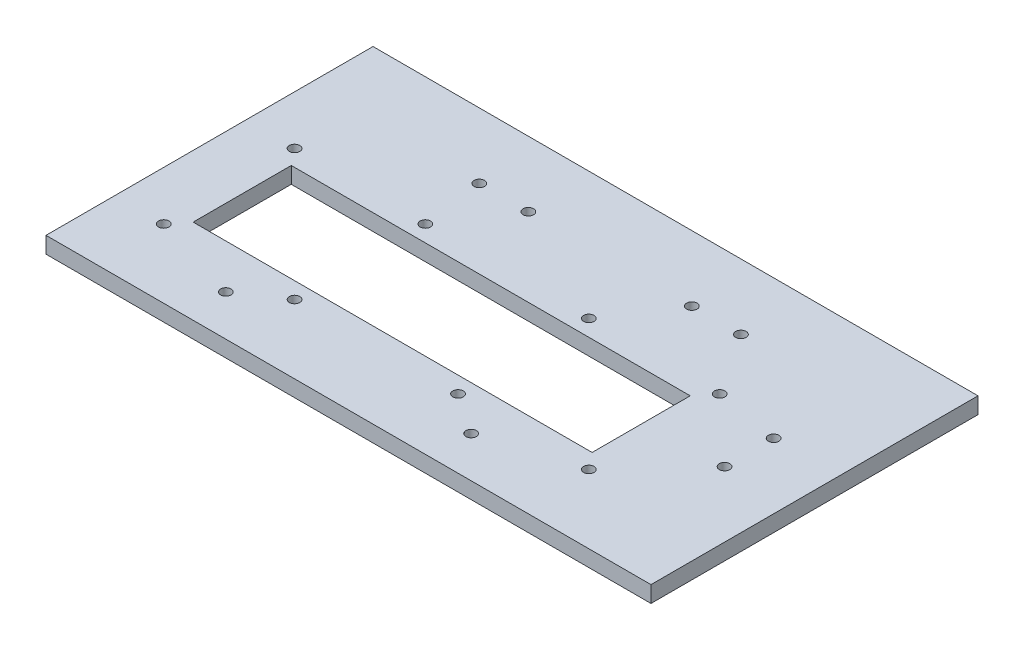
ISO-10303-21;
HEADER;
FILE_DESCRIPTION(('STEP AP214'),'2;1');
FILE_NAME('part.step','',(''),(''),'','','');
FILE_SCHEMA(('AUTOMOTIVE_DESIGN { 1 0 10303 214 1 1 1 1 }'));
ENDSEC;
DATA;
#1=APPLICATION_CONTEXT('core data for automotive mechanical design processes');
#2=APPLICATION_PROTOCOL_DEFINITION('international standard','automotive_design',2000,#1);
#3=PRODUCT_CONTEXT('',#1,'mechanical');
#4=PRODUCT('Part','Part','',(#3));
#5=PRODUCT_RELATED_PRODUCT_CATEGORY('part','',(#4));
#6=PRODUCT_DEFINITION_FORMATION('','',#4);
#7=PRODUCT_DEFINITION_CONTEXT('part definition',#1,'design');
#8=PRODUCT_DEFINITION('design','',#6,#7);
#9=PRODUCT_DEFINITION_SHAPE('','',#8);
#10=(LENGTH_UNIT() NAMED_UNIT(*) SI_UNIT(.MILLI.,.METRE.));
#11=(NAMED_UNIT(*) PLANE_ANGLE_UNIT() SI_UNIT($,.RADIAN.));
#12=(NAMED_UNIT(*) SI_UNIT($,.STERADIAN.) SOLID_ANGLE_UNIT());
#13=UNCERTAINTY_MEASURE_WITH_UNIT(LENGTH_MEASURE(1.E-05),#10,'distance_accuracy_value','');
#14=(GEOMETRIC_REPRESENTATION_CONTEXT(3) GLOBAL_UNCERTAINTY_ASSIGNED_CONTEXT((#13)) GLOBAL_UNIT_ASSIGNED_CONTEXT((#10,
#11,#12)) REPRESENTATION_CONTEXT('',''));
#15=CARTESIAN_POINT('',(0.,0.,0.));
#16=DIRECTION('',(0.,0.,1.));
#17=DIRECTION('',(1.,0.,0.));
#18=AXIS2_PLACEMENT_3D('',#15,#16,#17);
#19=CARTESIAN_POINT('',(0.,5.,0.));
#20=DIRECTION('',(0.,-1.,0.));
#21=DIRECTION('',(0.,0.,-1.));
#22=AXIS2_PLACEMENT_3D('',#19,#20,#21);
#23=PLANE('',#22);
#24=CARTESIAN_POINT('',(85.,5.,-1.49999999999997));
#25=DIRECTION('',(0.,-1.,0.));
#26=DIRECTION('',(0.,0.,-1.));
#27=AXIS2_PLACEMENT_3D('',#24,#25,#26);
#28=CIRCLE('',#27,1.60000000000001);
#29=CARTESIAN_POINT('',(85.,5.,-3.09999999999997));
#30=VERTEX_POINT('',#29);
#31=EDGE_CURVE('E287',#30,#30,#28,.F.);
#32=ORIENTED_EDGE('',*,*,#31,.F.);
#33=EDGE_LOOP('',(#32));
#34=FACE_BOUND('',#33,.T.);
#35=CARTESIAN_POINT('',(85.,5.,-16.5));
#36=DIRECTION('',(0.,-1.,0.));
#37=DIRECTION('',(0.,0.,-1.));
#38=AXIS2_PLACEMENT_3D('',#35,#36,#37);
#39=CIRCLE('',#38,1.6);
#40=CARTESIAN_POINT('',(85.,5.,-18.1));
#41=VERTEX_POINT('',#40);
#42=EDGE_CURVE('E293',#41,#41,#39,.F.);
#43=ORIENTED_EDGE('',*,*,#42,.F.);
#44=EDGE_LOOP('',(#43));
#45=FACE_BOUND('',#44,.T.);
#46=CARTESIAN_POINT('',(-37.5,5.,28.5));
#47=DIRECTION('',(0.,1.,0.));
#48=DIRECTION('',(0.,0.,1.));
#49=AXIS2_PLACEMENT_3D('',#46,#47,#48);
#50=CIRCLE('',#49,1.6);
#51=CARTESIAN_POINT('',(-37.5,5.,30.1));
#52=VERTEX_POINT('',#51);
#53=EDGE_CURVE('E301',#52,#52,#50,.T.);
#54=ORIENTED_EDGE('',*,*,#53,.F.);
#55=EDGE_LOOP('',(#54));
#56=FACE_BOUND('',#55,.T.);
#57=CARTESIAN_POINT('',(37.5,5.,28.4999999999998));
#58=DIRECTION('',(0.,1.,0.));
#59=DIRECTION('',(0.,0.,-1.));
#60=AXIS2_PLACEMENT_3D('',#57,#58,#59);
#61=CIRCLE('',#60,1.6);
#62=CARTESIAN_POINT('',(37.5,5.,26.8999999999998));
#63=VERTEX_POINT('',#62);
#64=EDGE_CURVE('E291',#63,#63,#61,.T.);
#65=ORIENTED_EDGE('',*,*,#64,.F.);
#66=EDGE_LOOP('',(#65));
#67=FACE_BOUND('',#66,.T.);
#68=CARTESIAN_POINT('',(-27.5,5.,-39.));
#69=DIRECTION('',(0.,1.,0.));
#70=DIRECTION('',(0.,0.,1.));
#71=AXIS2_PLACEMENT_3D('',#68,#69,#70);
#72=CIRCLE('',#71,1.6);
#73=CARTESIAN_POINT('',(-27.5,5.,-37.4));
#74=VERTEX_POINT('',#73);
#75=EDGE_CURVE('E310',#74,#74,#72,.T.);
#76=ORIENTED_EDGE('',*,*,#75,.F.);
#77=EDGE_LOOP('',(#76));
#78=FACE_BOUND('',#77,.T.);
#79=CARTESIAN_POINT('',(-12.5,5.,-39.));
#80=DIRECTION('',(0.,1.,0.));
#81=DIRECTION('',(0.,0.,1.));
#82=AXIS2_PLACEMENT_3D('',#79,#80,#81);
#83=CIRCLE('',#82,1.6);
#84=CARTESIAN_POINT('',(-12.5,5.,-37.4));
#85=VERTEX_POINT('',#84);
#86=EDGE_CURVE('E317',#85,#85,#83,.T.);
#87=ORIENTED_EDGE('',*,*,#86,.F.);
#88=EDGE_LOOP('',(#87));
#89=FACE_BOUND('',#88,.T.);
#90=CARTESIAN_POINT('',(37.5,5.,-39.));
#91=DIRECTION('',(0.,1.,0.));
#92=DIRECTION('',(0.,0.,-1.));
#93=AXIS2_PLACEMENT_3D('',#90,#91,#92);
#94=CIRCLE('',#93,1.6);
#95=CARTESIAN_POINT('',(37.5,5.,-40.6));
#96=VERTEX_POINT('',#95);
#97=EDGE_CURVE('E323',#96,#96,#94,.T.);
#98=ORIENTED_EDGE('',*,*,#97,.F.);
#99=EDGE_LOOP('',(#98));
#100=FACE_BOUND('',#99,.T.);
#101=CARTESIAN_POINT('',(52.5,5.,-39.));
#102=DIRECTION('',(0.,1.,0.));
#103=DIRECTION('',(0.,0.,-1.));
#104=AXIS2_PLACEMENT_3D('',#101,#102,#103);
#105=CIRCLE('',#104,1.6);
#106=CARTESIAN_POINT('',(52.5,5.,-40.6));
#107=VERTEX_POINT('',#106);
#108=EDGE_CURVE('E329',#107,#107,#105,.T.);
#109=ORIENTED_EDGE('',*,*,#108,.F.);
#110=EDGE_LOOP('',(#109));
#111=FACE_BOUND('',#110,.T.);
#112=CARTESIAN_POINT('',(25.,5.,-20.));
#113=DIRECTION('',(0.,-1.,0.));
#114=DIRECTION('',(0.,0.,-1.));
#115=AXIS2_PLACEMENT_3D('',#112,#113,#114);
#116=CIRCLE('',#115,1.6);
#117=CARTESIAN_POINT('',(25.,5.,-21.6));
#118=VERTEX_POINT('',#117);
#119=EDGE_CURVE('E356',#118,#118,#116,.T.);
#120=ORIENTED_EDGE('',*,*,#119,.T.);
#121=EDGE_LOOP('',(#120));
#122=FACE_BOUND('',#121,.T.);
#123=CARTESIAN_POINT('',(25.0000000000004,5.,20.));
#124=DIRECTION('',(0.,-1.,0.));
#125=DIRECTION('',(0.,0.,-1.));
#126=AXIS2_PLACEMENT_3D('',#123,#124,#125);
#127=CIRCLE('',#126,1.6);
#128=CARTESIAN_POINT('',(25.0000000000004,5.,18.4));
#129=VERTEX_POINT('',#128);
#130=EDGE_CURVE('E362',#129,#129,#127,.T.);
#131=ORIENTED_EDGE('',*,*,#130,.T.);
#132=EDGE_LOOP('',(#131));
#133=FACE_BOUND('',#132,.T.);
#134=CARTESIAN_POINT('',(-24.9999999999996,5.,20.));
#135=DIRECTION('',(0.,-1.,0.));
#136=DIRECTION('',(0.,0.,-1.));
#137=AXIS2_PLACEMENT_3D('',#134,#135,#136);
#138=CIRCLE('',#137,1.6);
#139=CARTESIAN_POINT('',(-24.9999999999996,5.,18.4));
#140=VERTEX_POINT('',#139);
#141=EDGE_CURVE('E368',#140,#140,#138,.T.);
#142=ORIENTED_EDGE('',*,*,#141,.T.);
#143=EDGE_LOOP('',(#142));
#144=FACE_BOUND('',#143,.T.);
#145=CARTESIAN_POINT('',(-65.,5.,-20.));
#146=DIRECTION('',(0.,-1.,0.));
#147=DIRECTION('',(0.,0.,-1.));
#148=AXIS2_PLACEMENT_3D('',#145,#146,#147);
#149=CIRCLE('',#148,1.6);
#150=CARTESIAN_POINT('',(-65.,5.,-21.6));
#151=VERTEX_POINT('',#150);
#152=EDGE_CURVE('E337',#151,#151,#149,.T.);
#153=ORIENTED_EDGE('',*,*,#152,.T.);
#154=EDGE_LOOP('',(#153));
#155=FACE_BOUND('',#154,.T.);
#156=CARTESIAN_POINT('',(65.,5.,-20.));
#157=DIRECTION('',(0.,-1.,0.));
#158=DIRECTION('',(0.,0.,-1.));
#159=AXIS2_PLACEMENT_3D('',#156,#157,#158);
#160=CIRCLE('',#159,1.6);
#161=CARTESIAN_POINT('',(65.,5.,-21.6));
#162=VERTEX_POINT('',#161);
#163=EDGE_CURVE('E338',#162,#162,#160,.T.);
#164=ORIENTED_EDGE('',*,*,#163,.T.);
#165=EDGE_LOOP('',(#164));
#166=FACE_BOUND('',#165,.T.);
#167=CARTESIAN_POINT('',(65.0000000000004,5.,20.));
#168=DIRECTION('',(0.,-1.,0.));
#169=DIRECTION('',(0.,0.,-1.));
#170=AXIS2_PLACEMENT_3D('',#167,#168,#169);
#171=CIRCLE('',#170,1.6);
#172=CARTESIAN_POINT('',(65.0000000000004,5.,18.4));
#173=VERTEX_POINT('',#172);
#174=EDGE_CURVE('E344',#173,#173,#171,.T.);
#175=ORIENTED_EDGE('',*,*,#174,.T.);
#176=EDGE_LOOP('',(#175));
#177=FACE_BOUND('',#176,.T.);
#178=CARTESIAN_POINT('',(-64.9999999999996,5.,20.));
#179=DIRECTION('',(0.,-1.,0.));
#180=DIRECTION('',(0.,0.,-1.));
#181=AXIS2_PLACEMENT_3D('',#178,#179,#180);
#182=CIRCLE('',#181,1.6);
#183=CARTESIAN_POINT('',(-64.9999999999996,5.,18.4));
#184=VERTEX_POINT('',#183);
#185=EDGE_CURVE('E313',#184,#184,#182,.T.);
#186=ORIENTED_EDGE('',*,*,#185,.T.);
#187=EDGE_LOOP('',(#186));
#188=FACE_BOUND('',#187,.T.);
#189=CARTESIAN_POINT('',(-25.,5.,-20.));
#190=DIRECTION('',(0.,-1.,0.));
#191=DIRECTION('',(0.,0.,-1.));
#192=AXIS2_PLACEMENT_3D('',#189,#190,#191);
#193=CIRCLE('',#192,1.6);
#194=CARTESIAN_POINT('',(-25.,5.,-21.6));
#195=VERTEX_POINT('',#194);
#196=EDGE_CURVE('E355',#195,#195,#193,.T.);
#197=ORIENTED_EDGE('',*,*,#196,.T.);
#198=EDGE_LOOP('',(#197));
#199=FACE_BOUND('',#198,.T.);
#200=DIRECTION('',(-1.,0.,0.));
#201=VECTOR('',#200,1.);
#202=CARTESIAN_POINT('',(105.,5.,-59.));
#203=LINE('',#202,#201);
#204=CARTESIAN_POINT('',(105.,5.,-59.));
#205=VERTEX_POINT('',#204);
#206=CARTESIAN_POINT('',(-80.,5.,-59.));
#207=VERTEX_POINT('',#206);
#208=EDGE_CURVE('E136',#205,#207,#203,.T.);
#209=ORIENTED_EDGE('',*,*,#208,.T.);
#210=DIRECTION('',(0.,0.,1.));
#211=VECTOR('',#210,1.);
#212=CARTESIAN_POINT('',(-80.,5.,41.));
#213=LINE('',#212,#211);
#214=CARTESIAN_POINT('',(-80.,5.,41.));
#215=VERTEX_POINT('',#214);
#216=EDGE_CURVE('E139',#207,#215,#213,.T.);
#217=ORIENTED_EDGE('',*,*,#216,.T.);
#218=DIRECTION('',(1.,0.,0.));
#219=VECTOR('',#218,1.);
#220=CARTESIAN_POINT('',(105.,5.,41.));
#221=LINE('',#220,#219);
#222=CARTESIAN_POINT('',(105.,5.,41.));
#223=VERTEX_POINT('',#222);
#224=EDGE_CURVE('E142',#215,#223,#221,.T.);
#225=ORIENTED_EDGE('',*,*,#224,.T.);
#226=DIRECTION('',(0.,0.,-1.));
#227=VECTOR('',#226,1.);
#228=CARTESIAN_POINT('',(105.,5.,41.));
#229=LINE('',#228,#227);
#230=EDGE_CURVE('E144',#223,#205,#229,.T.);
#231=ORIENTED_EDGE('',*,*,#230,.T.);
#232=EDGE_LOOP('',(#209,#217,#225,#231));
#233=FACE_BOUND('',#232,.T.);
#234=DIRECTION('',(0.,0.,-1.));
#235=VECTOR('',#234,1.);
#236=CARTESIAN_POINT('',(61.,5.,15.));
#237=LINE('',#236,#235);
#238=CARTESIAN_POINT('',(61.,5.,15.));
#239=VERTEX_POINT('',#238);
#240=CARTESIAN_POINT('',(61.,5.,-15.));
#241=VERTEX_POINT('',#240);
#242=EDGE_CURVE('E98',#239,#241,#237,.T.);
#243=ORIENTED_EDGE('',*,*,#242,.F.);
#244=DIRECTION('',(1.,0.,0.));
#245=VECTOR('',#244,1.);
#246=CARTESIAN_POINT('',(-61.,5.,15.));
#247=LINE('',#246,#245);
#248=CARTESIAN_POINT('',(-61.,5.,15.));
#249=VERTEX_POINT('',#248);
#250=EDGE_CURVE('E120',#249,#239,#247,.T.);
#251=ORIENTED_EDGE('',*,*,#250,.F.);
#252=DIRECTION('',(0.,0.,1.));
#253=VECTOR('',#252,1.);
#254=CARTESIAN_POINT('',(-61.,5.,15.));
#255=LINE('',#254,#253);
#256=CARTESIAN_POINT('',(-61.,5.,-15.));
#257=VERTEX_POINT('',#256);
#258=EDGE_CURVE('E118',#257,#249,#255,.T.);
#259=ORIENTED_EDGE('',*,*,#258,.F.);
#260=DIRECTION('',(-1.,0.,0.));
#261=VECTOR('',#260,1.);
#262=CARTESIAN_POINT('',(-61.,5.,-15.));
#263=LINE('',#262,#261);
#264=EDGE_CURVE('E106',#241,#257,#263,.T.);
#265=ORIENTED_EDGE('',*,*,#264,.F.);
#266=EDGE_LOOP('',(#243,#251,#259,#265));
#267=FACE_BOUND('',#266,.T.);
#268=ADVANCED_FACE('F33',(#34,#45,#56,#67,#78,#89,#100,#111,#122,#133,#144,#155,#166,#177,#188,
#199,#233,#267),#23,.F.);
#269=CARTESIAN_POINT('',(0.,0.,0.));
#270=DIRECTION('',(0.,-1.,0.));
#271=DIRECTION('',(0.,0.,-1.));
#272=AXIS2_PLACEMENT_3D('',#269,#270,#271);
#273=PLANE('',#272);
#274=CARTESIAN_POINT('',(85.,0.,-1.49999999999997));
#275=DIRECTION('',(0.,-1.,0.));
#276=DIRECTION('',(0.,0.,-1.));
#277=AXIS2_PLACEMENT_3D('',#274,#275,#276);
#278=CIRCLE('',#277,1.60000000000001);
#279=CARTESIAN_POINT('',(85.,0.,-3.09999999999997));
#280=VERTEX_POINT('',#279);
#281=EDGE_CURVE('E285',#280,#280,#278,.T.);
#282=ORIENTED_EDGE('',*,*,#281,.F.);
#283=EDGE_LOOP('',(#282));
#284=FACE_BOUND('',#283,.T.);
#285=CARTESIAN_POINT('',(85.,0.,-16.5));
#286=DIRECTION('',(0.,-1.,0.));
#287=DIRECTION('',(0.,0.,1.));
#288=AXIS2_PLACEMENT_3D('',#285,#286,#287);
#289=CIRCLE('',#288,1.6);
#290=CARTESIAN_POINT('',(85.,0.,-14.9));
#291=VERTEX_POINT('',#290);
#292=EDGE_CURVE('E296',#291,#291,#289,.T.);
#293=ORIENTED_EDGE('',*,*,#292,.F.);
#294=EDGE_LOOP('',(#293));
#295=FACE_BOUND('',#294,.T.);
#296=CARTESIAN_POINT('',(-37.5,0.,28.5));
#297=DIRECTION('',(0.,-1.,0.));
#298=DIRECTION('',(0.,0.,-1.));
#299=AXIS2_PLACEMENT_3D('',#296,#297,#298);
#300=CIRCLE('',#299,1.6);
#301=CARTESIAN_POINT('',(-37.5,0.,26.9));
#302=VERTEX_POINT('',#301);
#303=EDGE_CURVE('E305',#302,#302,#300,.F.);
#304=ORIENTED_EDGE('',*,*,#303,.T.);
#305=EDGE_LOOP('',(#304));
#306=FACE_BOUND('',#305,.T.);
#307=CARTESIAN_POINT('',(37.5,0.,28.4999999999998));
#308=DIRECTION('',(0.,-1.,0.));
#309=DIRECTION('',(0.,0.,-1.));
#310=AXIS2_PLACEMENT_3D('',#307,#308,#309);
#311=CIRCLE('',#310,1.6);
#312=CARTESIAN_POINT('',(37.5,0.,26.8999999999998));
#313=VERTEX_POINT('',#312);
#314=EDGE_CURVE('E288',#313,#313,#311,.F.);
#315=ORIENTED_EDGE('',*,*,#314,.T.);
#316=EDGE_LOOP('',(#315));
#317=FACE_BOUND('',#316,.T.);
#318=CARTESIAN_POINT('',(-27.5,0.,-39.));
#319=DIRECTION('',(0.,-1.,0.));
#320=DIRECTION('',(0.,0.,-1.));
#321=AXIS2_PLACEMENT_3D('',#318,#319,#320);
#322=CIRCLE('',#321,1.6);
#323=CARTESIAN_POINT('',(-27.5,0.,-40.6));
#324=VERTEX_POINT('',#323);
#325=EDGE_CURVE('E314',#324,#324,#322,.F.);
#326=ORIENTED_EDGE('',*,*,#325,.T.);
#327=EDGE_LOOP('',(#326));
#328=FACE_BOUND('',#327,.T.);
#329=CARTESIAN_POINT('',(-12.5,0.,-39.));
#330=DIRECTION('',(0.,-1.,0.));
#331=DIRECTION('',(0.,0.,-1.));
#332=AXIS2_PLACEMENT_3D('',#329,#330,#331);
#333=CIRCLE('',#332,1.6);
#334=CARTESIAN_POINT('',(-12.5,0.,-40.6));
#335=VERTEX_POINT('',#334);
#336=EDGE_CURVE('E320',#335,#335,#333,.F.);
#337=ORIENTED_EDGE('',*,*,#336,.T.);
#338=EDGE_LOOP('',(#337));
#339=FACE_BOUND('',#338,.T.);
#340=CARTESIAN_POINT('',(37.5,0.,-39.));
#341=DIRECTION('',(0.,-1.,0.));
#342=DIRECTION('',(0.,0.,-1.));
#343=AXIS2_PLACEMENT_3D('',#340,#341,#342);
#344=CIRCLE('',#343,1.6);
#345=CARTESIAN_POINT('',(37.5,0.,-40.6));
#346=VERTEX_POINT('',#345);
#347=EDGE_CURVE('E326',#346,#346,#344,.F.);
#348=ORIENTED_EDGE('',*,*,#347,.T.);
#349=EDGE_LOOP('',(#348));
#350=FACE_BOUND('',#349,.T.);
#351=CARTESIAN_POINT('',(52.5,0.,-39.));
#352=DIRECTION('',(0.,-1.,0.));
#353=DIRECTION('',(0.,0.,-1.));
#354=AXIS2_PLACEMENT_3D('',#351,#352,#353);
#355=CIRCLE('',#354,1.6);
#356=CARTESIAN_POINT('',(52.5,0.,-40.6));
#357=VERTEX_POINT('',#356);
#358=EDGE_CURVE('E304',#357,#357,#355,.F.);
#359=ORIENTED_EDGE('',*,*,#358,.T.);
#360=EDGE_LOOP('',(#359));
#361=FACE_BOUND('',#360,.T.);
#362=CARTESIAN_POINT('',(25.,0.,-20.));
#363=DIRECTION('',(0.,1.,0.));
#364=DIRECTION('',(0.,0.,1.));
#365=AXIS2_PLACEMENT_3D('',#362,#363,#364);
#366=CIRCLE('',#365,1.6);
#367=CARTESIAN_POINT('',(25.,0.,-18.4));
#368=VERTEX_POINT('',#367);
#369=EDGE_CURVE('E352',#368,#368,#366,.T.);
#370=ORIENTED_EDGE('',*,*,#369,.T.);
#371=EDGE_LOOP('',(#370));
#372=FACE_BOUND('',#371,.T.);
#373=CARTESIAN_POINT('',(25.0000000000004,0.,20.));
#374=DIRECTION('',(0.,1.,0.));
#375=DIRECTION('',(0.,0.,1.));
#376=AXIS2_PLACEMENT_3D('',#373,#374,#375);
#377=CIRCLE('',#376,1.6);
#378=CARTESIAN_POINT('',(25.0000000000004,0.,21.6));
#379=VERTEX_POINT('',#378);
#380=EDGE_CURVE('E359',#379,#379,#377,.T.);
#381=ORIENTED_EDGE('',*,*,#380,.T.);
#382=EDGE_LOOP('',(#381));
#383=FACE_BOUND('',#382,.T.);
#384=CARTESIAN_POINT('',(-24.9999999999996,0.,20.));
#385=DIRECTION('',(0.,1.,0.));
#386=DIRECTION('',(0.,0.,1.));
#387=AXIS2_PLACEMENT_3D('',#384,#385,#386);
#388=CIRCLE('',#387,1.6);
#389=CARTESIAN_POINT('',(-24.9999999999996,0.,21.6));
#390=VERTEX_POINT('',#389);
#391=EDGE_CURVE('E365',#390,#390,#388,.T.);
#392=ORIENTED_EDGE('',*,*,#391,.T.);
#393=EDGE_LOOP('',(#392));
#394=FACE_BOUND('',#393,.T.);
#395=CARTESIAN_POINT('',(-65.,0.,-20.));
#396=DIRECTION('',(0.,1.,0.));
#397=DIRECTION('',(0.,0.,1.));
#398=AXIS2_PLACEMENT_3D('',#395,#396,#397);
#399=CIRCLE('',#398,1.6);
#400=CARTESIAN_POINT('',(-65.,0.,-18.4));
#401=VERTEX_POINT('',#400);
#402=EDGE_CURVE('E371',#401,#401,#399,.T.);
#403=ORIENTED_EDGE('',*,*,#402,.T.);
#404=EDGE_LOOP('',(#403));
#405=FACE_BOUND('',#404,.T.);
#406=CARTESIAN_POINT('',(65.,0.,-20.));
#407=DIRECTION('',(0.,1.,0.));
#408=DIRECTION('',(0.,0.,1.));
#409=AXIS2_PLACEMENT_3D('',#406,#407,#408);
#410=CIRCLE('',#409,1.6);
#411=CARTESIAN_POINT('',(65.,0.,-18.4));
#412=VERTEX_POINT('',#411);
#413=EDGE_CURVE('E334',#412,#412,#410,.T.);
#414=ORIENTED_EDGE('',*,*,#413,.T.);
#415=EDGE_LOOP('',(#414));
#416=FACE_BOUND('',#415,.T.);
#417=CARTESIAN_POINT('',(65.0000000000004,0.,20.));
#418=DIRECTION('',(0.,1.,0.));
#419=DIRECTION('',(0.,0.,1.));
#420=AXIS2_PLACEMENT_3D('',#417,#418,#419);
#421=CIRCLE('',#420,1.6);
#422=CARTESIAN_POINT('',(65.0000000000004,0.,21.6));
#423=VERTEX_POINT('',#422);
#424=EDGE_CURVE('E341',#423,#423,#421,.T.);
#425=ORIENTED_EDGE('',*,*,#424,.T.);
#426=EDGE_LOOP('',(#425));
#427=FACE_BOUND('',#426,.T.);
#428=CARTESIAN_POINT('',(-64.9999999999996,0.,20.));
#429=DIRECTION('',(0.,1.,0.));
#430=DIRECTION('',(0.,0.,1.));
#431=AXIS2_PLACEMENT_3D('',#428,#429,#430);
#432=CIRCLE('',#431,1.6);
#433=CARTESIAN_POINT('',(-64.9999999999996,0.,21.6));
#434=VERTEX_POINT('',#433);
#435=EDGE_CURVE('E347',#434,#434,#432,.T.);
#436=ORIENTED_EDGE('',*,*,#435,.T.);
#437=EDGE_LOOP('',(#436));
#438=FACE_BOUND('',#437,.T.);
#439=CARTESIAN_POINT('',(-25.,0.,-20.));
#440=DIRECTION('',(0.,1.,0.));
#441=DIRECTION('',(0.,0.,1.));
#442=AXIS2_PLACEMENT_3D('',#439,#440,#441);
#443=CIRCLE('',#442,1.6);
#444=CARTESIAN_POINT('',(-25.,0.,-18.4));
#445=VERTEX_POINT('',#444);
#446=EDGE_CURVE('E126',#445,#445,#443,.T.);
#447=ORIENTED_EDGE('',*,*,#446,.T.);
#448=EDGE_LOOP('',(#447));
#449=FACE_BOUND('',#448,.T.);
#450=DIRECTION('',(-1.,0.,0.));
#451=VECTOR('',#450,1.);
#452=CARTESIAN_POINT('',(105.,0.,-59.));
#453=LINE('',#452,#451);
#454=CARTESIAN_POINT('',(105.,0.,-59.));
#455=VERTEX_POINT('',#454);
#456=CARTESIAN_POINT('',(-80.,0.,-59.));
#457=VERTEX_POINT('',#456);
#458=EDGE_CURVE('E114',#455,#457,#453,.T.);
#459=ORIENTED_EDGE('',*,*,#458,.F.);
#460=DIRECTION('',(0.,0.,-1.));
#461=VECTOR('',#460,1.);
#462=CARTESIAN_POINT('',(105.,0.,41.));
#463=LINE('',#462,#461);
#464=CARTESIAN_POINT('',(105.,0.,41.));
#465=VERTEX_POINT('',#464);
#466=EDGE_CURVE('E140',#465,#455,#463,.T.);
#467=ORIENTED_EDGE('',*,*,#466,.F.);
#468=DIRECTION('',(1.,0.,0.));
#469=VECTOR('',#468,1.);
#470=CARTESIAN_POINT('',(105.,0.,41.));
#471=LINE('',#470,#469);
#472=CARTESIAN_POINT('',(-80.,0.,41.));
#473=VERTEX_POINT('',#472);
#474=EDGE_CURVE('E151',#473,#465,#471,.T.);
#475=ORIENTED_EDGE('',*,*,#474,.F.);
#476=DIRECTION('',(0.,0.,1.));
#477=VECTOR('',#476,1.);
#478=CARTESIAN_POINT('',(-80.,0.,41.));
#479=LINE('',#478,#477);
#480=EDGE_CURVE('E149',#457,#473,#479,.T.);
#481=ORIENTED_EDGE('',*,*,#480,.F.);
#482=EDGE_LOOP('',(#459,#467,#475,#481));
#483=FACE_BOUND('',#482,.T.);
#484=DIRECTION('',(1.,0.,0.));
#485=VECTOR('',#484,1.);
#486=CARTESIAN_POINT('',(-61.,0.,15.));
#487=LINE('',#486,#485);
#488=CARTESIAN_POINT('',(-61.,0.,15.));
#489=VERTEX_POINT('',#488);
#490=CARTESIAN_POINT('',(61.,0.,15.));
#491=VERTEX_POINT('',#490);
#492=EDGE_CURVE('E107',#489,#491,#487,.T.);
#493=ORIENTED_EDGE('',*,*,#492,.T.);
#494=DIRECTION('',(0.,0.,-1.));
#495=VECTOR('',#494,1.);
#496=CARTESIAN_POINT('',(61.,0.,15.));
#497=LINE('',#496,#495);
#498=CARTESIAN_POINT('',(61.,0.,-15.));
#499=VERTEX_POINT('',#498);
#500=EDGE_CURVE('E56',#491,#499,#497,.T.);
#501=ORIENTED_EDGE('',*,*,#500,.T.);
#502=DIRECTION('',(-1.,0.,0.));
#503=VECTOR('',#502,1.);
#504=CARTESIAN_POINT('',(-61.,0.,-15.));
#505=LINE('',#504,#503);
#506=CARTESIAN_POINT('',(-61.,0.,-15.));
#507=VERTEX_POINT('',#506);
#508=EDGE_CURVE('E113',#499,#507,#505,.T.);
#509=ORIENTED_EDGE('',*,*,#508,.T.);
#510=DIRECTION('',(0.,0.,1.));
#511=VECTOR('',#510,1.);
#512=CARTESIAN_POINT('',(-61.,0.,15.));
#513=LINE('',#512,#511);
#514=EDGE_CURVE('E128',#507,#489,#513,.T.);
#515=ORIENTED_EDGE('',*,*,#514,.T.);
#516=EDGE_LOOP('',(#493,#501,#509,#515));
#517=FACE_BOUND('',#516,.T.);
#518=ADVANCED_FACE('F169',(#284,#295,#306,#317,#328,#339,#350,#361,#372,#383,#394,#405,#416,
#427,#438,#449,#483,#517),#273,.T.);
#519=CARTESIAN_POINT('',(105.,5.,-59.));
#520=DIRECTION('',(0.,0.,1.));
#521=DIRECTION('',(1.,0.,0.));
#522=AXIS2_PLACEMENT_3D('',#519,#520,#521);
#523=PLANE('',#522);
#524=ORIENTED_EDGE('',*,*,#458,.T.);
#525=DIRECTION('',(0.,-1.,0.));
#526=VECTOR('',#525,1.);
#527=CARTESIAN_POINT('',(-80.,5.,-59.));
#528=LINE('',#527,#526);
#529=EDGE_CURVE('E11',#207,#457,#528,.T.);
#530=ORIENTED_EDGE('',*,*,#529,.F.);
#531=ORIENTED_EDGE('',*,*,#208,.F.);
#532=DIRECTION('',(0.,-1.,0.));
#533=VECTOR('',#532,1.);
#534=CARTESIAN_POINT('',(105.,5.,-59.));
#535=LINE('',#534,#533);
#536=EDGE_CURVE('E146',#205,#455,#535,.T.);
#537=ORIENTED_EDGE('',*,*,#536,.T.);
#538=EDGE_LOOP('',(#524,#530,#531,#537));
#539=FACE_BOUND('',#538,.T.);
#540=ADVANCED_FACE('F35',(#539),#523,.F.);
#541=CARTESIAN_POINT('',(-80.,5.,41.));
#542=DIRECTION('',(1.,0.,0.));
#543=DIRECTION('',(0.,0.,-1.));
#544=AXIS2_PLACEMENT_3D('',#541,#542,#543);
#545=PLANE('',#544);
#546=ORIENTED_EDGE('',*,*,#480,.T.);
#547=DIRECTION('',(0.,-1.,0.));
#548=VECTOR('',#547,1.);
#549=CARTESIAN_POINT('',(-80.,5.,41.));
#550=LINE('',#549,#548);
#551=EDGE_CURVE('E41',#215,#473,#550,.T.);
#552=ORIENTED_EDGE('',*,*,#551,.F.);
#553=ORIENTED_EDGE('',*,*,#216,.F.);
#554=ORIENTED_EDGE('',*,*,#529,.T.);
#555=EDGE_LOOP('',(#546,#552,#553,#554));
#556=FACE_BOUND('',#555,.T.);
#557=ADVANCED_FACE('F179',(#556),#545,.F.);
#558=CARTESIAN_POINT('',(105.,5.,41.));
#559=DIRECTION('',(0.,0.,-1.));
#560=DIRECTION('',(-1.,0.,0.));
#561=AXIS2_PLACEMENT_3D('',#558,#559,#560);
#562=PLANE('',#561);
#563=ORIENTED_EDGE('',*,*,#474,.T.);
#564=DIRECTION('',(0.,-1.,0.));
#565=VECTOR('',#564,1.);
#566=CARTESIAN_POINT('',(105.,5.,41.));
#567=LINE('',#566,#565);
#568=EDGE_CURVE('E156',#223,#465,#567,.T.);
#569=ORIENTED_EDGE('',*,*,#568,.F.);
#570=ORIENTED_EDGE('',*,*,#224,.F.);
#571=ORIENTED_EDGE('',*,*,#551,.T.);
#572=EDGE_LOOP('',(#563,#569,#570,#571));
#573=FACE_BOUND('',#572,.T.);
#574=ADVANCED_FACE('F163',(#573),#562,.F.);
#575=CARTESIAN_POINT('',(105.,5.,41.));
#576=DIRECTION('',(-1.,0.,0.));
#577=DIRECTION('',(0.,0.,1.));
#578=AXIS2_PLACEMENT_3D('',#575,#576,#577);
#579=PLANE('',#578);
#580=ORIENTED_EDGE('',*,*,#466,.T.);
#581=ORIENTED_EDGE('',*,*,#536,.F.);
#582=ORIENTED_EDGE('',*,*,#230,.F.);
#583=ORIENTED_EDGE('',*,*,#568,.T.);
#584=EDGE_LOOP('',(#580,#581,#582,#583));
#585=FACE_BOUND('',#584,.T.);
#586=ADVANCED_FACE('F173',(#585),#579,.F.);
#587=CARTESIAN_POINT('',(61.,5.,15.));
#588=DIRECTION('',(-1.,0.,0.));
#589=DIRECTION('',(0.,0.,1.));
#590=AXIS2_PLACEMENT_3D('',#587,#588,#589);
#591=PLANE('',#590);
#592=ORIENTED_EDGE('',*,*,#500,.F.);
#593=DIRECTION('',(0.,-1.,0.));
#594=VECTOR('',#593,1.);
#595=CARTESIAN_POINT('',(61.,5.,15.));
#596=LINE('',#595,#594);
#597=EDGE_CURVE('E102',#239,#491,#596,.T.);
#598=ORIENTED_EDGE('',*,*,#597,.F.);
#599=ORIENTED_EDGE('',*,*,#242,.T.);
#600=DIRECTION('',(0.,-1.,0.));
#601=VECTOR('',#600,1.);
#602=CARTESIAN_POINT('',(61.,5.,-15.));
#603=LINE('',#602,#601);
#604=EDGE_CURVE('E101',#241,#499,#603,.T.);
#605=ORIENTED_EDGE('',*,*,#604,.T.);
#606=EDGE_LOOP('',(#592,#598,#599,#605));
#607=FACE_BOUND('',#606,.T.);
#608=ADVANCED_FACE('F100',(#607),#591,.T.);
#609=CARTESIAN_POINT('',(-61.,5.,-15.));
#610=DIRECTION('',(0.,0.,1.));
#611=DIRECTION('',(1.,0.,0.));
#612=AXIS2_PLACEMENT_3D('',#609,#610,#611);
#613=PLANE('',#612);
#614=ORIENTED_EDGE('',*,*,#508,.F.);
#615=ORIENTED_EDGE('',*,*,#604,.F.);
#616=ORIENTED_EDGE('',*,*,#264,.T.);
#617=DIRECTION('',(0.,-1.,0.));
#618=VECTOR('',#617,1.);
#619=CARTESIAN_POINT('',(-61.,5.,-15.));
#620=LINE('',#619,#618);
#621=EDGE_CURVE('E115',#257,#507,#620,.T.);
#622=ORIENTED_EDGE('',*,*,#621,.T.);
#623=EDGE_LOOP('',(#614,#615,#616,#622));
#624=FACE_BOUND('',#623,.T.);
#625=ADVANCED_FACE('F110',(#624),#613,.T.);
#626=CARTESIAN_POINT('',(-61.,5.,15.));
#627=DIRECTION('',(1.,0.,0.));
#628=DIRECTION('',(0.,0.,-1.));
#629=AXIS2_PLACEMENT_3D('',#626,#627,#628);
#630=PLANE('',#629);
#631=ORIENTED_EDGE('',*,*,#514,.F.);
#632=ORIENTED_EDGE('',*,*,#621,.F.);
#633=ORIENTED_EDGE('',*,*,#258,.T.);
#634=DIRECTION('',(0.,-1.,0.));
#635=VECTOR('',#634,1.);
#636=CARTESIAN_POINT('',(-61.,5.,15.));
#637=LINE('',#636,#635);
#638=EDGE_CURVE('E48',#249,#489,#637,.T.);
#639=ORIENTED_EDGE('',*,*,#638,.T.);
#640=EDGE_LOOP('',(#631,#632,#633,#639));
#641=FACE_BOUND('',#640,.T.);
#642=ADVANCED_FACE('F207',(#641),#630,.T.);
#643=CARTESIAN_POINT('',(-61.,5.,15.));
#644=DIRECTION('',(0.,0.,-1.));
#645=DIRECTION('',(-1.,0.,0.));
#646=AXIS2_PLACEMENT_3D('',#643,#644,#645);
#647=PLANE('',#646);
#648=ORIENTED_EDGE('',*,*,#492,.F.);
#649=ORIENTED_EDGE('',*,*,#638,.F.);
#650=ORIENTED_EDGE('',*,*,#250,.T.);
#651=ORIENTED_EDGE('',*,*,#597,.T.);
#652=EDGE_LOOP('',(#648,#649,#650,#651));
#653=FACE_BOUND('',#652,.T.);
#654=ADVANCED_FACE('F211',(#653),#647,.T.);
#655=CARTESIAN_POINT('',(-25.,5.001,-20.));
#656=DIRECTION('',(0.,-1.,0.));
#657=DIRECTION('',(0.,0.,-1.));
#658=AXIS2_PLACEMENT_3D('',#655,#656,#657);
#659=CYLINDRICAL_SURFACE('',#658,1.6);
#660=ORIENTED_EDGE('',*,*,#446,.F.);
#661=EDGE_LOOP('',(#660));
#662=FACE_BOUND('',#661,.T.);
#663=ORIENTED_EDGE('',*,*,#196,.F.);
#664=EDGE_LOOP('',(#663));
#665=FACE_BOUND('',#664,.T.);
#666=ADVANCED_FACE('F217',(#662,#665),#659,.F.);
#667=CARTESIAN_POINT('',(-64.9999999999996,5.001,20.));
#668=DIRECTION('',(0.,-1.,0.));
#669=DIRECTION('',(0.,0.,-1.));
#670=AXIS2_PLACEMENT_3D('',#667,#668,#669);
#671=CYLINDRICAL_SURFACE('',#670,1.6);
#672=ORIENTED_EDGE('',*,*,#435,.F.);
#673=EDGE_LOOP('',(#672));
#674=FACE_BOUND('',#673,.T.);
#675=ORIENTED_EDGE('',*,*,#185,.F.);
#676=EDGE_LOOP('',(#675));
#677=FACE_BOUND('',#676,.T.);
#678=ADVANCED_FACE('F220',(#674,#677),#671,.F.);
#679=CARTESIAN_POINT('',(65.0000000000004,5.001,20.));
#680=DIRECTION('',(0.,-1.,0.));
#681=DIRECTION('',(0.,0.,-1.));
#682=AXIS2_PLACEMENT_3D('',#679,#680,#681);
#683=CYLINDRICAL_SURFACE('',#682,1.6);
#684=ORIENTED_EDGE('',*,*,#424,.F.);
#685=EDGE_LOOP('',(#684));
#686=FACE_BOUND('',#685,.T.);
#687=ORIENTED_EDGE('',*,*,#174,.F.);
#688=EDGE_LOOP('',(#687));
#689=FACE_BOUND('',#688,.T.);
#690=ADVANCED_FACE('F242',(#686,#689),#683,.F.);
#691=CARTESIAN_POINT('',(65.,5.001,-20.));
#692=DIRECTION('',(0.,-1.,0.));
#693=DIRECTION('',(0.,0.,-1.));
#694=AXIS2_PLACEMENT_3D('',#691,#692,#693);
#695=CYLINDRICAL_SURFACE('',#694,1.6);
#696=ORIENTED_EDGE('',*,*,#413,.F.);
#697=EDGE_LOOP('',(#696));
#698=FACE_BOUND('',#697,.T.);
#699=ORIENTED_EDGE('',*,*,#163,.F.);
#700=EDGE_LOOP('',(#699));
#701=FACE_BOUND('',#700,.T.);
#702=ADVANCED_FACE('F226',(#698,#701),#695,.F.);
#703=CARTESIAN_POINT('',(-65.,5.001,-20.));
#704=DIRECTION('',(0.,-1.,0.));
#705=DIRECTION('',(0.,0.,-1.));
#706=AXIS2_PLACEMENT_3D('',#703,#704,#705);
#707=CYLINDRICAL_SURFACE('',#706,1.6);
#708=ORIENTED_EDGE('',*,*,#402,.F.);
#709=EDGE_LOOP('',(#708));
#710=FACE_BOUND('',#709,.T.);
#711=ORIENTED_EDGE('',*,*,#152,.F.);
#712=EDGE_LOOP('',(#711));
#713=FACE_BOUND('',#712,.T.);
#714=ADVANCED_FACE('F222',(#710,#713),#707,.F.);
#715=CARTESIAN_POINT('',(-24.9999999999996,5.001,20.));
#716=DIRECTION('',(0.,-1.,0.));
#717=DIRECTION('',(0.,0.,-1.));
#718=AXIS2_PLACEMENT_3D('',#715,#716,#717);
#719=CYLINDRICAL_SURFACE('',#718,1.6);
#720=ORIENTED_EDGE('',*,*,#391,.F.);
#721=EDGE_LOOP('',(#720));
#722=FACE_BOUND('',#721,.T.);
#723=ORIENTED_EDGE('',*,*,#141,.F.);
#724=EDGE_LOOP('',(#723));
#725=FACE_BOUND('',#724,.T.);
#726=ADVANCED_FACE('F225',(#722,#725),#719,.F.);
#727=CARTESIAN_POINT('',(25.0000000000004,5.001,20.));
#728=DIRECTION('',(0.,-1.,0.));
#729=DIRECTION('',(0.,0.,-1.));
#730=AXIS2_PLACEMENT_3D('',#727,#728,#729);
#731=CYLINDRICAL_SURFACE('',#730,1.6);
#732=ORIENTED_EDGE('',*,*,#380,.F.);
#733=EDGE_LOOP('',(#732));
#734=FACE_BOUND('',#733,.T.);
#735=ORIENTED_EDGE('',*,*,#130,.F.);
#736=EDGE_LOOP('',(#735));
#737=FACE_BOUND('',#736,.T.);
#738=ADVANCED_FACE('F230',(#734,#737),#731,.F.);
#739=CARTESIAN_POINT('',(25.,5.001,-20.));
#740=DIRECTION('',(0.,-1.,0.));
#741=DIRECTION('',(0.,0.,-1.));
#742=AXIS2_PLACEMENT_3D('',#739,#740,#741);
#743=CYLINDRICAL_SURFACE('',#742,1.6);
#744=ORIENTED_EDGE('',*,*,#369,.F.);
#745=EDGE_LOOP('',(#744));
#746=FACE_BOUND('',#745,.T.);
#747=ORIENTED_EDGE('',*,*,#119,.F.);
#748=EDGE_LOOP('',(#747));
#749=FACE_BOUND('',#748,.T.);
#750=ADVANCED_FACE('F234',(#746,#749),#743,.F.);
#751=CARTESIAN_POINT('',(52.5,-0.00100000000000013,-39.));
#752=DIRECTION('',(0.,1.,0.));
#753=DIRECTION('',(0.,0.,1.));
#754=AXIS2_PLACEMENT_3D('',#751,#752,#753);
#755=CYLINDRICAL_SURFACE('',#754,1.6);
#756=ORIENTED_EDGE('',*,*,#358,.F.);
#757=EDGE_LOOP('',(#756));
#758=FACE_BOUND('',#757,.T.);
#759=ORIENTED_EDGE('',*,*,#108,.T.);
#760=EDGE_LOOP('',(#759));
#761=FACE_BOUND('',#760,.T.);
#762=ADVANCED_FACE('F238',(#758,#761),#755,.F.);
#763=CARTESIAN_POINT('',(37.5,-0.00100000000000013,-39.));
#764=DIRECTION('',(0.,1.,0.));
#765=DIRECTION('',(0.,0.,1.));
#766=AXIS2_PLACEMENT_3D('',#763,#764,#765);
#767=CYLINDRICAL_SURFACE('',#766,1.6);
#768=ORIENTED_EDGE('',*,*,#347,.F.);
#769=EDGE_LOOP('',(#768));
#770=FACE_BOUND('',#769,.T.);
#771=ORIENTED_EDGE('',*,*,#97,.T.);
#772=EDGE_LOOP('',(#771));
#773=FACE_BOUND('',#772,.T.);
#774=ADVANCED_FACE('F252',(#770,#773),#767,.F.);
#775=CARTESIAN_POINT('',(-12.5,-0.00100000000000013,-39.));
#776=DIRECTION('',(0.,1.,0.));
#777=DIRECTION('',(0.,0.,1.));
#778=AXIS2_PLACEMENT_3D('',#775,#776,#777);
#779=CYLINDRICAL_SURFACE('',#778,1.6);
#780=ORIENTED_EDGE('',*,*,#336,.F.);
#781=EDGE_LOOP('',(#780));
#782=FACE_BOUND('',#781,.T.);
#783=ORIENTED_EDGE('',*,*,#86,.T.);
#784=EDGE_LOOP('',(#783));
#785=FACE_BOUND('',#784,.T.);
#786=ADVANCED_FACE('F256',(#782,#785),#779,.F.);
#787=CARTESIAN_POINT('',(-27.5,-0.00100000000000013,-39.));
#788=DIRECTION('',(0.,1.,0.));
#789=DIRECTION('',(0.,0.,1.));
#790=AXIS2_PLACEMENT_3D('',#787,#788,#789);
#791=CYLINDRICAL_SURFACE('',#790,1.6);
#792=ORIENTED_EDGE('',*,*,#325,.F.);
#793=EDGE_LOOP('',(#792));
#794=FACE_BOUND('',#793,.T.);
#795=ORIENTED_EDGE('',*,*,#75,.T.);
#796=EDGE_LOOP('',(#795));
#797=FACE_BOUND('',#796,.T.);
#798=ADVANCED_FACE('F260',(#794,#797),#791,.F.);
#799=CARTESIAN_POINT('',(37.5,-0.00100000000000013,28.4999999999998));
#800=DIRECTION('',(0.,1.,0.));
#801=DIRECTION('',(0.,0.,1.));
#802=AXIS2_PLACEMENT_3D('',#799,#800,#801);
#803=CYLINDRICAL_SURFACE('',#802,1.6);
#804=ORIENTED_EDGE('',*,*,#314,.F.);
#805=EDGE_LOOP('',(#804));
#806=FACE_BOUND('',#805,.T.);
#807=ORIENTED_EDGE('',*,*,#64,.T.);
#808=EDGE_LOOP('',(#807));
#809=FACE_BOUND('',#808,.T.);
#810=ADVANCED_FACE('F264',(#806,#809),#803,.F.);
#811=CARTESIAN_POINT('',(-37.5,-0.00100000000000013,28.5));
#812=DIRECTION('',(0.,1.,0.));
#813=DIRECTION('',(0.,0.,1.));
#814=AXIS2_PLACEMENT_3D('',#811,#812,#813);
#815=CYLINDRICAL_SURFACE('',#814,1.6);
#816=ORIENTED_EDGE('',*,*,#303,.F.);
#817=EDGE_LOOP('',(#816));
#818=FACE_BOUND('',#817,.T.);
#819=ORIENTED_EDGE('',*,*,#53,.T.);
#820=EDGE_LOOP('',(#819));
#821=FACE_BOUND('',#820,.T.);
#822=ADVANCED_FACE('F268',(#818,#821),#815,.F.);
#823=CARTESIAN_POINT('',(85.,5.001,-16.5));
#824=DIRECTION('',(0.,-1.,0.));
#825=DIRECTION('',(0.,0.,-1.));
#826=AXIS2_PLACEMENT_3D('',#823,#824,#825);
#827=CYLINDRICAL_SURFACE('',#826,1.6);
#828=ORIENTED_EDGE('',*,*,#292,.T.);
#829=EDGE_LOOP('',(#828));
#830=FACE_BOUND('',#829,.T.);
#831=ORIENTED_EDGE('',*,*,#42,.T.);
#832=EDGE_LOOP('',(#831));
#833=FACE_BOUND('',#832,.T.);
#834=ADVANCED_FACE('F272',(#830,#833),#827,.F.);
#835=CARTESIAN_POINT('',(85.,5.001,-1.49999999999997));
#836=DIRECTION('',(0.,-1.,0.));
#837=DIRECTION('',(0.,0.,-1.));
#838=AXIS2_PLACEMENT_3D('',#835,#836,#837);
#839=CYLINDRICAL_SURFACE('',#838,1.60000000000001);
#840=ORIENTED_EDGE('',*,*,#281,.T.);
#841=EDGE_LOOP('',(#840));
#842=FACE_BOUND('',#841,.T.);
#843=ORIENTED_EDGE('',*,*,#31,.T.);
#844=EDGE_LOOP('',(#843));
#845=FACE_BOUND('',#844,.T.);
#846=ADVANCED_FACE('F276',(#842,#845),#839,.F.);
#847=CLOSED_SHELL('',(#268,#518,#540,#557,#574,#586,#608,#625,#642,#654,#666,#678,#690,#702,
#714,#726,#738,#750,#762,#774,#786,#798,#810,#822,#834,#846));
#848=MANIFOLD_SOLID_BREP('B2',#847);
#849=ADVANCED_BREP_SHAPE_REPRESENTATION('',(#18,#848),#14);
#850=SHAPE_DEFINITION_REPRESENTATION(#9,#849);
ENDSEC;
END-ISO-10303-21;
